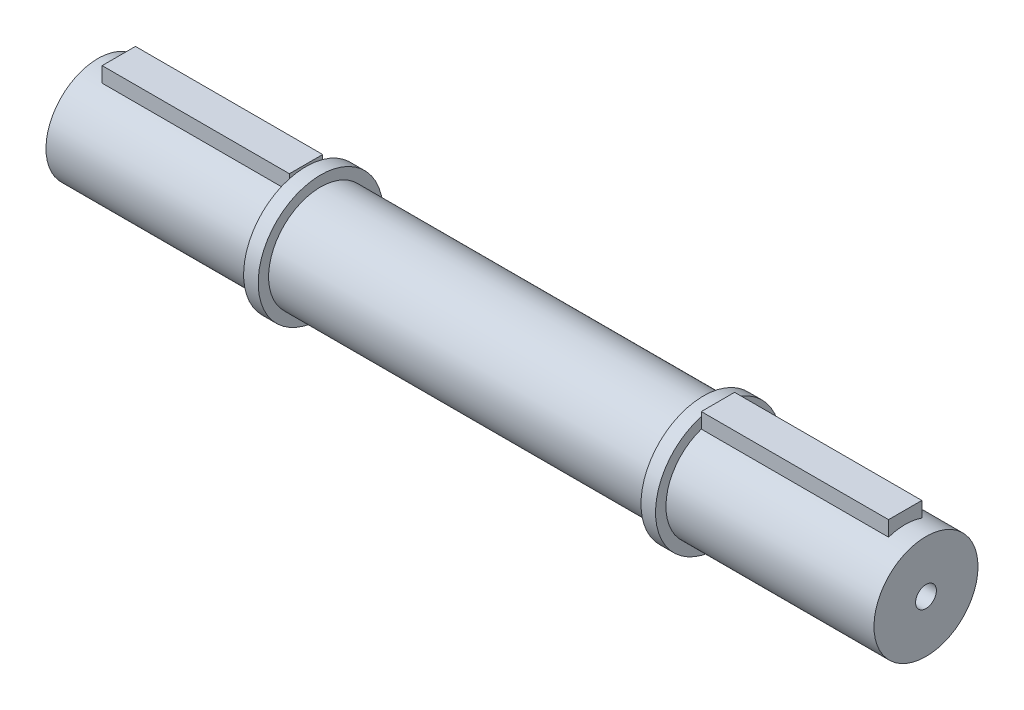
ISO-10303-21;
HEADER;
FILE_DESCRIPTION(('STEP AP214'),'2;1');
FILE_NAME('part.step','',(''),(''),'','','');
FILE_SCHEMA(('AUTOMOTIVE_DESIGN { 1 0 10303 214 1 1 1 1 }'));
ENDSEC;
DATA;
#1=APPLICATION_CONTEXT('core data for automotive mechanical design processes');
#2=APPLICATION_PROTOCOL_DEFINITION('international standard','automotive_design',2000,#1);
#3=PRODUCT_CONTEXT('',#1,'mechanical');
#4=PRODUCT('Part','Part','',(#3));
#5=PRODUCT_RELATED_PRODUCT_CATEGORY('part','',(#4));
#6=PRODUCT_DEFINITION_FORMATION('','',#4);
#7=PRODUCT_DEFINITION_CONTEXT('part definition',#1,'design');
#8=PRODUCT_DEFINITION('design','',#6,#7);
#9=PRODUCT_DEFINITION_SHAPE('','',#8);
#10=(LENGTH_UNIT() NAMED_UNIT(*) SI_UNIT(.MILLI.,.METRE.));
#11=(NAMED_UNIT(*) PLANE_ANGLE_UNIT() SI_UNIT($,.RADIAN.));
#12=(NAMED_UNIT(*) SI_UNIT($,.STERADIAN.) SOLID_ANGLE_UNIT());
#13=UNCERTAINTY_MEASURE_WITH_UNIT(LENGTH_MEASURE(1.E-05),#10,'distance_accuracy_value','');
#14=(GEOMETRIC_REPRESENTATION_CONTEXT(3) GLOBAL_UNCERTAINTY_ASSIGNED_CONTEXT((#13)) GLOBAL_UNIT_ASSIGNED_CONTEXT((#10,
#11,#12)) REPRESENTATION_CONTEXT('',''));
#15=CARTESIAN_POINT('',(0.,0.,0.));
#16=DIRECTION('',(0.,0.,1.));
#17=DIRECTION('',(1.,0.,0.));
#18=AXIS2_PLACEMENT_3D('',#15,#16,#17);
#19=CARTESIAN_POINT('',(99.5,0.,0.));
#20=DIRECTION('',(-1.,0.,0.));
#21=DIRECTION('',(0.,0.,1.));
#22=AXIS2_PLACEMENT_3D('',#19,#20,#21);
#23=CYLINDRICAL_SURFACE('',#22,12.5);
#24=CARTESIAN_POINT('',(-46.,0.,0.));
#25=DIRECTION('',(1.,0.,0.));
#26=DIRECTION('',(0.,0.,-1.));
#27=AXIS2_PLACEMENT_3D('',#24,#25,#26);
#28=CIRCLE('',#27,12.5);
#29=CARTESIAN_POINT('',(-46.,0.,-12.5));
#30=VERTEX_POINT('',#29);
#31=EDGE_CURVE('E41',#30,#30,#28,.T.);
#32=ORIENTED_EDGE('',*,*,#31,.T.);
#33=EDGE_LOOP('',(#32));
#34=FACE_BOUND('',#33,.T.);
#35=CARTESIAN_POINT('',(46.,0.,0.));
#36=DIRECTION('',(1.,0.,0.));
#37=DIRECTION('',(0.,0.,-1.));
#38=AXIS2_PLACEMENT_3D('',#35,#36,#37);
#39=CIRCLE('',#38,12.5);
#40=CARTESIAN_POINT('',(46.,0.,-12.5));
#41=VERTEX_POINT('',#40);
#42=EDGE_CURVE('E207',#41,#41,#39,.T.);
#43=ORIENTED_EDGE('',*,*,#42,.F.);
#44=EDGE_LOOP('',(#43));
#45=FACE_BOUND('',#44,.T.);
#46=ADVANCED_FACE('F38',(#34,#45),#23,.T.);
#47=CARTESIAN_POINT('',(46.,0.,0.));
#48=DIRECTION('',(1.,0.,0.));
#49=DIRECTION('',(0.,0.,-1.));
#50=AXIS2_PLACEMENT_3D('',#47,#48,#49);
#51=PLANE('',#50);
#52=ORIENTED_EDGE('',*,*,#42,.T.);
#53=EDGE_LOOP('',(#52));
#54=FACE_BOUND('',#53,.T.);
#55=CARTESIAN_POINT('',(46.,0.,0.));
#56=DIRECTION('',(1.,0.,0.));
#57=DIRECTION('',(0.,0.,-1.));
#58=AXIS2_PLACEMENT_3D('',#55,#56,#57);
#59=CIRCLE('',#58,15.);
#60=CARTESIAN_POINT('',(46.,0.,-15.));
#61=VERTEX_POINT('',#60);
#62=EDGE_CURVE('E191',#61,#61,#59,.T.);
#63=ORIENTED_EDGE('',*,*,#62,.F.);
#64=EDGE_LOOP('',(#63));
#65=FACE_BOUND('',#64,.T.);
#66=ADVANCED_FACE('F249',(#54,#65),#51,.F.);
#67=CARTESIAN_POINT('',(91.9264068711929,0.,0.));
#68=DIRECTION('',(-1.,0.,0.));
#69=DIRECTION('',(0.,0.,1.));
#70=AXIS2_PLACEMENT_3D('',#67,#68,#69);
#71=CYLINDRICAL_SURFACE('',#70,15.);
#72=CARTESIAN_POINT('',(49.5,0.,0.));
#73=DIRECTION('',(-1.,0.,0.));
#74=DIRECTION('',(0.,0.,1.));
#75=AXIS2_PLACEMENT_3D('',#72,#73,#74);
#76=CIRCLE('',#75,15.);
#77=CARTESIAN_POINT('',(49.5,14.456832294801,4.));
#78=VERTEX_POINT('',#77);
#79=CARTESIAN_POINT('',(49.5,14.456832294801,-4.));
#80=VERTEX_POINT('',#79);
#81=EDGE_CURVE('E195',#78,#80,#76,.T.);
#82=ORIENTED_EDGE('',*,*,#81,.T.);
#83=EDGE_CURVE('E194',#80,#78,#76,.T.);
#84=ORIENTED_EDGE('',*,*,#83,.T.);
#85=EDGE_LOOP('',(#82,#84));
#86=FACE_BOUND('',#85,.T.);
#87=ORIENTED_EDGE('',*,*,#62,.T.);
#88=EDGE_LOOP('',(#87));
#89=FACE_BOUND('',#88,.T.);
#90=ADVANCED_FACE('F230',(#86,#89),#71,.T.);
#91=CARTESIAN_POINT('',(49.5,0.,0.));
#92=DIRECTION('',(-1.,0.,0.));
#93=DIRECTION('',(0.,0.,1.));
#94=AXIS2_PLACEMENT_3D('',#91,#92,#93);
#95=PLANE('',#94);
#96=CARTESIAN_POINT('',(49.5,0.,0.));
#97=DIRECTION('',(-1.,0.,0.));
#98=DIRECTION('',(0.,0.,1.));
#99=AXIS2_PLACEMENT_3D('',#96,#97,#98);
#100=CIRCLE('',#99,12.5);
#101=CARTESIAN_POINT('',(49.5,11.842719282327,-4.));
#102=VERTEX_POINT('',#101);
#103=CARTESIAN_POINT('',(49.5,11.842719282327,4.));
#104=VERTEX_POINT('',#103);
#105=EDGE_CURVE('E202',#102,#104,#100,.T.);
#106=ORIENTED_EDGE('',*,*,#105,.T.);
#107=DIRECTION('',(0.,1.,0.));
#108=VECTOR('',#107,1.);
#109=CARTESIAN_POINT('',(49.5,15.5,4.));
#110=LINE('',#109,#108);
#111=EDGE_CURVE('E171',#104,#78,#110,.T.);
#112=ORIENTED_EDGE('',*,*,#111,.T.);
#113=ORIENTED_EDGE('',*,*,#83,.F.);
#114=DIRECTION('',(0.,-1.,0.));
#115=VECTOR('',#114,1.);
#116=CARTESIAN_POINT('',(49.5,15.5,-4.));
#117=LINE('',#116,#115);
#118=EDGE_CURVE('E167',#80,#102,#117,.T.);
#119=ORIENTED_EDGE('',*,*,#118,.T.);
#120=EDGE_LOOP('',(#106,#112,#113,#119));
#121=FACE_BOUND('',#120,.T.);
#122=ADVANCED_FACE('F227',(#121),#95,.F.);
#123=CARTESIAN_POINT('',(99.5,0.,0.));
#124=DIRECTION('',(1.,0.,0.));
#125=DIRECTION('',(0.,0.,-1.));
#126=AXIS2_PLACEMENT_3D('',#123,#124,#125);
#127=PLANE('',#126);
#128=CARTESIAN_POINT('',(99.5,0.,0.));
#129=DIRECTION('',(1.,0.,0.));
#130=DIRECTION('',(0.,0.,-1.));
#131=AXIS2_PLACEMENT_3D('',#128,#129,#130);
#132=CIRCLE('',#131,2.49999999999999);
#133=CARTESIAN_POINT('',(99.5,0.,-2.49999999999999));
#134=VERTEX_POINT('',#133);
#135=EDGE_CURVE('E301',#134,#134,#132,.T.);
#136=ORIENTED_EDGE('',*,*,#135,.F.);
#137=EDGE_LOOP('',(#136));
#138=FACE_BOUND('',#137,.T.);
#139=CARTESIAN_POINT('',(99.5,0.,0.));
#140=DIRECTION('',(1.,0.,0.));
#141=DIRECTION('',(0.,0.,-1.));
#142=AXIS2_PLACEMENT_3D('',#139,#140,#141);
#143=CIRCLE('',#142,12.5);
#144=CARTESIAN_POINT('',(99.5,0.,-12.5));
#145=VERTEX_POINT('',#144);
#146=EDGE_CURVE('E199',#145,#145,#143,.T.);
#147=ORIENTED_EDGE('',*,*,#146,.T.);
#148=EDGE_LOOP('',(#147));
#149=FACE_BOUND('',#148,.T.);
#150=ADVANCED_FACE('F264',(#138,#149),#127,.T.);
#151=ORIENTED_EDGE('',*,*,#146,.F.);
#152=EDGE_LOOP('',(#151));
#153=FACE_BOUND('',#152,.T.);
#154=CARTESIAN_POINT('',(94.5,0.,0.));
#155=DIRECTION('',(1.,0.,0.));
#156=DIRECTION('',(0.,0.,-1.));
#157=AXIS2_PLACEMENT_3D('',#154,#155,#156);
#158=CIRCLE('',#157,12.5);
#159=CARTESIAN_POINT('',(94.5,11.842719282327,-3.99999999999999));
#160=VERTEX_POINT('',#159);
#161=CARTESIAN_POINT('',(94.5,11.842719282327,4.));
#162=VERTEX_POINT('',#161);
#163=EDGE_CURVE('E46',#160,#162,#158,.T.);
#164=ORIENTED_EDGE('',*,*,#163,.T.);
#165=DIRECTION('',(-1.,0.,0.));
#166=VECTOR('',#165,1.);
#167=CARTESIAN_POINT('',(108.296345959992,11.842719282327,4.));
#168=LINE('',#167,#166);
#169=EDGE_CURVE('E185',#162,#104,#168,.T.);
#170=ORIENTED_EDGE('',*,*,#169,.T.);
#171=ORIENTED_EDGE('',*,*,#105,.F.);
#172=DIRECTION('',(-1.,0.,0.));
#173=VECTOR('',#172,1.);
#174=CARTESIAN_POINT('',(108.296345959992,11.842719282327,-4.));
#175=LINE('',#174,#173);
#176=EDGE_CURVE('E179',#160,#102,#175,.T.);
#177=ORIENTED_EDGE('',*,*,#176,.F.);
#178=EDGE_LOOP('',(#164,#170,#171,#177));
#179=FACE_BOUND('',#178,.T.);
#180=ADVANCED_FACE('F214',(#153,#179),#23,.T.);
#181=CARTESIAN_POINT('',(94.5,0.,0.));
#182=DIRECTION('',(1.,0.,0.));
#183=DIRECTION('',(0.,0.,-1.));
#184=AXIS2_PLACEMENT_3D('',#181,#182,#183);
#185=PLANE('',#184);
#186=ORIENTED_EDGE('',*,*,#163,.F.);
#187=DIRECTION('',(0.,-1.,0.));
#188=VECTOR('',#187,1.);
#189=CARTESIAN_POINT('',(94.5,15.5,-4.));
#190=LINE('',#189,#188);
#191=CARTESIAN_POINT('',(94.5,15.5,-4.));
#192=VERTEX_POINT('',#191);
#193=EDGE_CURVE('E177',#192,#160,#190,.T.);
#194=ORIENTED_EDGE('',*,*,#193,.F.);
#195=DIRECTION('',(0.,0.,-1.));
#196=VECTOR('',#195,1.);
#197=CARTESIAN_POINT('',(94.5,15.5,4.));
#198=LINE('',#197,#196);
#199=CARTESIAN_POINT('',(94.5,15.5,4.));
#200=VERTEX_POINT('',#199);
#201=EDGE_CURVE('E181',#200,#192,#198,.T.);
#202=ORIENTED_EDGE('',*,*,#201,.F.);
#203=DIRECTION('',(0.,1.,0.));
#204=VECTOR('',#203,1.);
#205=CARTESIAN_POINT('',(94.5,15.5,4.));
#206=LINE('',#205,#204);
#207=EDGE_CURVE('E166',#162,#200,#206,.T.);
#208=ORIENTED_EDGE('',*,*,#207,.F.);
#209=EDGE_LOOP('',(#186,#194,#202,#208));
#210=FACE_BOUND('',#209,.T.);
#211=ADVANCED_FACE('F218',(#210),#185,.T.);
#212=CARTESIAN_POINT('',(49.5,0.,0.));
#213=DIRECTION('',(1.,0.,0.));
#214=DIRECTION('',(0.,0.,-1.));
#215=AXIS2_PLACEMENT_3D('',#212,#213,#214);
#216=PLANE('',#215);
#217=CARTESIAN_POINT('',(49.5,15.5,-4.));
#218=VERTEX_POINT('',#217);
#219=EDGE_CURVE('E163',#218,#80,#117,.T.);
#220=ORIENTED_EDGE('',*,*,#219,.T.);
#221=ORIENTED_EDGE('',*,*,#81,.F.);
#222=CARTESIAN_POINT('',(49.5,15.5,4.));
#223=VERTEX_POINT('',#222);
#224=EDGE_CURVE('E162',#78,#223,#110,.T.);
#225=ORIENTED_EDGE('',*,*,#224,.T.);
#226=DIRECTION('',(0.,0.,-1.));
#227=VECTOR('',#226,1.);
#228=CARTESIAN_POINT('',(49.5,15.5,4.));
#229=LINE('',#228,#227);
#230=EDGE_CURVE('E168',#223,#218,#229,.T.);
#231=ORIENTED_EDGE('',*,*,#230,.T.);
#232=EDGE_LOOP('',(#220,#221,#225,#231));
#233=FACE_BOUND('',#232,.T.);
#234=ADVANCED_FACE('F233',(#233),#216,.F.);
#235=CARTESIAN_POINT('',(108.296345959992,15.5,4.));
#236=DIRECTION('',(0.,0.,1.));
#237=DIRECTION('',(0.,-1.,0.));
#238=AXIS2_PLACEMENT_3D('',#235,#236,#237);
#239=PLANE('',#238);
#240=ORIENTED_EDGE('',*,*,#169,.F.);
#241=ORIENTED_EDGE('',*,*,#207,.T.);
#242=DIRECTION('',(-1.,0.,0.));
#243=VECTOR('',#242,1.);
#244=CARTESIAN_POINT('',(108.296345959992,15.5,4.));
#245=LINE('',#244,#243);
#246=EDGE_CURVE('E176',#200,#223,#245,.T.);
#247=ORIENTED_EDGE('',*,*,#246,.T.);
#248=ORIENTED_EDGE('',*,*,#224,.F.);
#249=ORIENTED_EDGE('',*,*,#111,.F.);
#250=EDGE_LOOP('',(#240,#241,#247,#248,#249));
#251=FACE_BOUND('',#250,.T.);
#252=ADVANCED_FACE('F222',(#251),#239,.T.);
#253=CARTESIAN_POINT('',(108.296345959992,15.5,4.));
#254=DIRECTION('',(0.,1.,0.));
#255=DIRECTION('',(0.,0.,1.));
#256=AXIS2_PLACEMENT_3D('',#253,#254,#255);
#257=PLANE('',#256);
#258=ORIENTED_EDGE('',*,*,#246,.F.);
#259=ORIENTED_EDGE('',*,*,#201,.T.);
#260=DIRECTION('',(-1.,0.,0.));
#261=VECTOR('',#260,1.);
#262=CARTESIAN_POINT('',(108.296345959992,15.5,-4.));
#263=LINE('',#262,#261);
#264=EDGE_CURVE('E180',#192,#218,#263,.T.);
#265=ORIENTED_EDGE('',*,*,#264,.T.);
#266=ORIENTED_EDGE('',*,*,#230,.F.);
#267=EDGE_LOOP('',(#258,#259,#265,#266));
#268=FACE_BOUND('',#267,.T.);
#269=ADVANCED_FACE('F239',(#268),#257,.T.);
#270=CARTESIAN_POINT('',(108.296345959992,15.5,-4.));
#271=DIRECTION('',(0.,0.,-1.));
#272=DIRECTION('',(0.,1.,0.));
#273=AXIS2_PLACEMENT_3D('',#270,#271,#272);
#274=PLANE('',#273);
#275=ORIENTED_EDGE('',*,*,#264,.F.);
#276=ORIENTED_EDGE('',*,*,#193,.T.);
#277=ORIENTED_EDGE('',*,*,#176,.T.);
#278=ORIENTED_EDGE('',*,*,#118,.F.);
#279=ORIENTED_EDGE('',*,*,#219,.F.);
#280=EDGE_LOOP('',(#275,#276,#277,#278,#279));
#281=FACE_BOUND('',#280,.T.);
#282=ADVANCED_FACE('F237',(#281),#274,.T.);
#283=CARTESIAN_POINT('',(-49.5,0.,0.));
#284=DIRECTION('',(-1.,0.,0.));
#285=DIRECTION('',(0.,0.,1.));
#286=AXIS2_PLACEMENT_3D('',#283,#284,#285);
#287=PLANE('',#286);
#288=CARTESIAN_POINT('',(-49.5,0.,0.));
#289=DIRECTION('',(-1.,0.,0.));
#290=DIRECTION('',(0.,0.,1.));
#291=AXIS2_PLACEMENT_3D('',#288,#289,#290);
#292=CIRCLE('',#291,12.5);
#293=CARTESIAN_POINT('',(-49.5,11.8427192822992,-4.00000000008239));
#294=VERTEX_POINT('',#293);
#295=CARTESIAN_POINT('',(-49.5,11.8427192823122,4.00000000004372));
#296=VERTEX_POINT('',#295);
#297=EDGE_CURVE('E141',#294,#296,#292,.T.);
#298=ORIENTED_EDGE('',*,*,#297,.F.);
#299=DIRECTION('',(0.,1.,0.));
#300=VECTOR('',#299,1.);
#301=CARTESIAN_POINT('',(-49.5,-291586.25,-3.99999999990541));
#302=LINE('',#301,#300);
#303=CARTESIAN_POINT('',(-49.5,14.4568322947889,-4.00000000004373));
#304=VERTEX_POINT('',#303);
#305=EDGE_CURVE('E136',#294,#304,#302,.T.);
#306=ORIENTED_EDGE('',*,*,#305,.T.);
#307=CARTESIAN_POINT('',(-49.5,0.,0.));
#308=DIRECTION('',(-1.,0.,0.));
#309=DIRECTION('',(0.,0.,1.));
#310=AXIS2_PLACEMENT_3D('',#307,#308,#309);
#311=CIRCLE('',#310,15.);
#312=CARTESIAN_POINT('',(-49.5,14.4568322947889,4.00000000004372));
#313=VERTEX_POINT('',#312);
#314=EDGE_CURVE('E134',#313,#304,#311,.F.);
#315=ORIENTED_EDGE('',*,*,#314,.F.);
#316=DIRECTION('',(0.,-1.,0.));
#317=VECTOR('',#316,1.);
#318=CARTESIAN_POINT('',(-49.5,-291586.25,3.99999999990541));
#319=LINE('',#318,#317);
#320=EDGE_CURVE('E122',#313,#296,#319,.T.);
#321=ORIENTED_EDGE('',*,*,#320,.T.);
#322=EDGE_LOOP('',(#298,#306,#315,#321));
#323=FACE_BOUND('',#322,.T.);
#324=ADVANCED_FACE('F135',(#323),#287,.T.);
#325=CARTESIAN_POINT('',(-46.,0.,0.));
#326=DIRECTION('',(1.,0.,0.));
#327=DIRECTION('',(0.,0.,-1.));
#328=AXIS2_PLACEMENT_3D('',#325,#326,#327);
#329=PLANE('',#328);
#330=ORIENTED_EDGE('',*,*,#31,.F.);
#331=EDGE_LOOP('',(#330));
#332=FACE_BOUND('',#331,.T.);
#333=CARTESIAN_POINT('',(-46.,0.,0.));
#334=DIRECTION('',(1.,0.,0.));
#335=DIRECTION('',(0.,0.,-1.));
#336=AXIS2_PLACEMENT_3D('',#333,#334,#335);
#337=CIRCLE('',#336,15.);
#338=CARTESIAN_POINT('',(-46.,0.,-15.));
#339=VERTEX_POINT('',#338);
#340=EDGE_CURVE('E138',#339,#339,#337,.T.);
#341=ORIENTED_EDGE('',*,*,#340,.T.);
#342=EDGE_LOOP('',(#341));
#343=FACE_BOUND('',#342,.T.);
#344=ADVANCED_FACE('F292',(#332,#343),#329,.T.);
#345=CARTESIAN_POINT('',(-91.9264068711929,0.,0.));
#346=DIRECTION('',(1.,0.,0.));
#347=DIRECTION('',(0.,0.,-1.));
#348=AXIS2_PLACEMENT_3D('',#345,#346,#347);
#349=CYLINDRICAL_SURFACE('',#348,15.);
#350=ORIENTED_EDGE('',*,*,#340,.F.);
#351=EDGE_LOOP('',(#350));
#352=FACE_BOUND('',#351,.T.);
#353=EDGE_CURVE('E53',#304,#313,#311,.F.);
#354=ORIENTED_EDGE('',*,*,#353,.T.);
#355=ORIENTED_EDGE('',*,*,#314,.T.);
#356=EDGE_LOOP('',(#354,#355));
#357=FACE_BOUND('',#356,.T.);
#358=ADVANCED_FACE('F140',(#352,#357),#349,.T.);
#359=CARTESIAN_POINT('',(-99.5,0.,0.));
#360=DIRECTION('',(1.,0.,0.));
#361=DIRECTION('',(0.,0.,-1.));
#362=AXIS2_PLACEMENT_3D('',#359,#360,#361);
#363=PLANE('',#362);
#364=CARTESIAN_POINT('',(-99.5,0.,0.));
#365=DIRECTION('',(1.,0.,0.));
#366=DIRECTION('',(0.,0.,-1.));
#367=AXIS2_PLACEMENT_3D('',#364,#365,#366);
#368=CIRCLE('',#367,2.49999999999997);
#369=CARTESIAN_POINT('',(-99.5,0.,-2.49999999999997));
#370=VERTEX_POINT('',#369);
#371=EDGE_CURVE('E298',#370,#370,#368,.T.);
#372=ORIENTED_EDGE('',*,*,#371,.T.);
#373=EDGE_LOOP('',(#372));
#374=FACE_BOUND('',#373,.T.);
#375=CARTESIAN_POINT('',(-99.5,0.,0.));
#376=DIRECTION('',(1.,0.,0.));
#377=DIRECTION('',(0.,0.,-1.));
#378=AXIS2_PLACEMENT_3D('',#375,#376,#377);
#379=CIRCLE('',#378,12.5);
#380=CARTESIAN_POINT('',(-99.5,0.,-12.5));
#381=VERTEX_POINT('',#380);
#382=EDGE_CURVE('E198',#381,#381,#379,.T.);
#383=ORIENTED_EDGE('',*,*,#382,.F.);
#384=EDGE_LOOP('',(#383));
#385=FACE_BOUND('',#384,.T.);
#386=ADVANCED_FACE('F281',(#374,#385),#363,.F.);
#387=CARTESIAN_POINT('',(-94.5,0.,0.));
#388=DIRECTION('',(1.,0.,0.));
#389=DIRECTION('',(0.,0.,-1.));
#390=AXIS2_PLACEMENT_3D('',#387,#388,#389);
#391=PLANE('',#390);
#392=DIRECTION('',(0.,-1.,0.));
#393=VECTOR('',#392,1.);
#394=CARTESIAN_POINT('',(-94.5,-291586.25,-3.99999999990541));
#395=LINE('',#394,#393);
#396=CARTESIAN_POINT('',(-94.5,15.4999999999745,-4.00000000004373));
#397=VERTEX_POINT('',#396);
#398=CARTESIAN_POINT('',(-94.5,11.8427192822992,-4.00000000008239));
#399=VERTEX_POINT('',#398);
#400=EDGE_CURVE('E146',#397,#399,#395,.T.);
#401=ORIENTED_EDGE('',*,*,#400,.T.);
#402=CARTESIAN_POINT('',(-94.5,0.,0.));
#403=DIRECTION('',(1.,0.,0.));
#404=DIRECTION('',(0.,0.,-1.));
#405=AXIS2_PLACEMENT_3D('',#402,#403,#404);
#406=CIRCLE('',#405,12.5);
#407=CARTESIAN_POINT('',(-94.5,11.8427192822992,4.0000000000191));
#408=VERTEX_POINT('',#407);
#409=EDGE_CURVE('E12',#399,#408,#406,.T.);
#410=ORIENTED_EDGE('',*,*,#409,.T.);
#411=DIRECTION('',(0.,1.,0.));
#412=VECTOR('',#411,1.);
#413=CARTESIAN_POINT('',(-94.5,-291586.25,3.99999999990541));
#414=LINE('',#413,#412);
#415=CARTESIAN_POINT('',(-94.5,15.4999999999745,4.00000000004373));
#416=VERTEX_POINT('',#415);
#417=EDGE_CURVE('E152',#408,#416,#414,.T.);
#418=ORIENTED_EDGE('',*,*,#417,.T.);
#419=DIRECTION('',(0.,0.,-1.));
#420=VECTOR('',#419,1.);
#421=CARTESIAN_POINT('',(-94.5,15.4999999999745,-400000.));
#422=LINE('',#421,#420);
#423=EDGE_CURVE('E149',#416,#397,#422,.T.);
#424=ORIENTED_EDGE('',*,*,#423,.T.);
#425=EDGE_LOOP('',(#401,#410,#418,#424));
#426=FACE_BOUND('',#425,.T.);
#427=ADVANCED_FACE('F283',(#426),#391,.F.);
#428=CARTESIAN_POINT('',(-108.296345960072,15.4999999999745,-400000.));
#429=DIRECTION('',(0.,1.,0.));
#430=DIRECTION('',(0.,0.,1.));
#431=AXIS2_PLACEMENT_3D('',#428,#429,#430);
#432=PLANE('',#431);
#433=ORIENTED_EDGE('',*,*,#423,.F.);
#434=DIRECTION('',(1.,0.,0.));
#435=VECTOR('',#434,1.);
#436=CARTESIAN_POINT('',(-108.296345960072,15.4999999999745,4.00000000004373));
#437=LINE('',#436,#435);
#438=CARTESIAN_POINT('',(-49.5,15.4999999999745,4.00000000004373));
#439=VERTEX_POINT('',#438);
#440=EDGE_CURVE('E155',#416,#439,#437,.T.);
#441=ORIENTED_EDGE('',*,*,#440,.T.);
#442=DIRECTION('',(0.,0.,1.));
#443=VECTOR('',#442,1.);
#444=CARTESIAN_POINT('',(-49.5,15.4999999999745,-400000.));
#445=LINE('',#444,#443);
#446=CARTESIAN_POINT('',(-49.5,15.4999999999745,-4.00000000004373));
#447=VERTEX_POINT('',#446);
#448=EDGE_CURVE('E118',#447,#439,#445,.T.);
#449=ORIENTED_EDGE('',*,*,#448,.F.);
#450=DIRECTION('',(1.,0.,0.));
#451=VECTOR('',#450,1.);
#452=CARTESIAN_POINT('',(-108.296345960072,15.4999999999745,-4.00000000004373));
#453=LINE('',#452,#451);
#454=EDGE_CURVE('E150',#397,#447,#453,.T.);
#455=ORIENTED_EDGE('',*,*,#454,.F.);
#456=EDGE_LOOP('',(#433,#441,#449,#455));
#457=FACE_BOUND('',#456,.T.);
#458=ADVANCED_FACE('F289',(#457),#432,.T.);
#459=CARTESIAN_POINT('',(-49.5,0.,0.));
#460=DIRECTION('',(1.,0.,0.));
#461=DIRECTION('',(0.,0.,-1.));
#462=AXIS2_PLACEMENT_3D('',#459,#460,#461);
#463=PLANE('',#462);
#464=ORIENTED_EDGE('',*,*,#353,.F.);
#465=EDGE_CURVE('E121',#304,#447,#302,.T.);
#466=ORIENTED_EDGE('',*,*,#465,.T.);
#467=ORIENTED_EDGE('',*,*,#448,.T.);
#468=EDGE_CURVE('E114',#439,#313,#319,.T.);
#469=ORIENTED_EDGE('',*,*,#468,.T.);
#470=EDGE_LOOP('',(#464,#466,#467,#469));
#471=FACE_BOUND('',#470,.T.);
#472=ADVANCED_FACE('F116',(#471),#463,.T.);
#473=CARTESIAN_POINT('',(-108.296345960072,-291586.25,3.99999999990541));
#474=DIRECTION('',(0.,0.,1.));
#475=DIRECTION('',(0.,-1.,0.));
#476=AXIS2_PLACEMENT_3D('',#473,#474,#475);
#477=PLANE('',#476);
#478=ORIENTED_EDGE('',*,*,#417,.F.);
#479=DIRECTION('',(1.,0.,0.));
#480=VECTOR('',#479,1.);
#481=CARTESIAN_POINT('',(-108.296345960072,11.8427192822992,4.0000000000191));
#482=LINE('',#481,#480);
#483=EDGE_CURVE('E129',#408,#296,#482,.T.);
#484=ORIENTED_EDGE('',*,*,#483,.T.);
#485=ORIENTED_EDGE('',*,*,#320,.F.);
#486=ORIENTED_EDGE('',*,*,#468,.F.);
#487=ORIENTED_EDGE('',*,*,#440,.F.);
#488=EDGE_LOOP('',(#478,#484,#485,#486,#487));
#489=FACE_BOUND('',#488,.T.);
#490=ADVANCED_FACE('F128',(#489),#477,.T.);
#491=CARTESIAN_POINT('',(-108.296345960072,-291586.25,-3.99999999990541));
#492=DIRECTION('',(0.,0.,-1.));
#493=DIRECTION('',(0.,1.,0.));
#494=AXIS2_PLACEMENT_3D('',#491,#492,#493);
#495=PLANE('',#494);
#496=ORIENTED_EDGE('',*,*,#400,.F.);
#497=ORIENTED_EDGE('',*,*,#454,.T.);
#498=ORIENTED_EDGE('',*,*,#465,.F.);
#499=ORIENTED_EDGE('',*,*,#305,.F.);
#500=DIRECTION('',(1.,0.,0.));
#501=VECTOR('',#500,1.);
#502=CARTESIAN_POINT('',(-108.296345960072,11.8427192822992,-4.00000000004372));
#503=LINE('',#502,#501);
#504=EDGE_CURVE('E61',#399,#294,#503,.T.);
#505=ORIENTED_EDGE('',*,*,#504,.F.);
#506=EDGE_LOOP('',(#496,#497,#498,#499,#505));
#507=FACE_BOUND('',#506,.T.);
#508=ADVANCED_FACE('F261',(#507),#495,.T.);
#509=ORIENTED_EDGE('',*,*,#382,.T.);
#510=EDGE_LOOP('',(#509));
#511=FACE_BOUND('',#510,.T.);
#512=ORIENTED_EDGE('',*,*,#504,.T.);
#513=ORIENTED_EDGE('',*,*,#297,.T.);
#514=ORIENTED_EDGE('',*,*,#483,.F.);
#515=ORIENTED_EDGE('',*,*,#409,.F.);
#516=EDGE_LOOP('',(#512,#513,#514,#515));
#517=FACE_BOUND('',#516,.T.);
#518=ADVANCED_FACE('F251',(#511,#517),#23,.T.);
#519=CARTESIAN_POINT('',(99.5,0.,0.));
#520=DIRECTION('',(1.,0.,0.));
#521=DIRECTION('',(0.,0.,-1.));
#522=AXIS2_PLACEMENT_3D('',#519,#520,#521);
#523=CYLINDRICAL_SURFACE('',#522,2.49999999999998);
#524=ORIENTED_EDGE('',*,*,#371,.F.);
#525=EDGE_LOOP('',(#524));
#526=FACE_BOUND('',#525,.T.);
#527=ORIENTED_EDGE('',*,*,#135,.T.);
#528=EDGE_LOOP('',(#527));
#529=FACE_BOUND('',#528,.T.);
#530=ADVANCED_FACE('F260',(#526,#529),#523,.F.);
#531=CLOSED_SHELL('',(#46,#66,#90,#122,#150,#180,#211,#234,#252,#269,#282,#324,#344,#358,#386,
#427,#458,#472,#490,#508,#518,#530));
#532=MANIFOLD_SOLID_BREP('B2',#531);
#533=ADVANCED_BREP_SHAPE_REPRESENTATION('',(#18,#532),#14);
#534=SHAPE_DEFINITION_REPRESENTATION(#9,#533);
ENDSEC;
END-ISO-10303-21;
